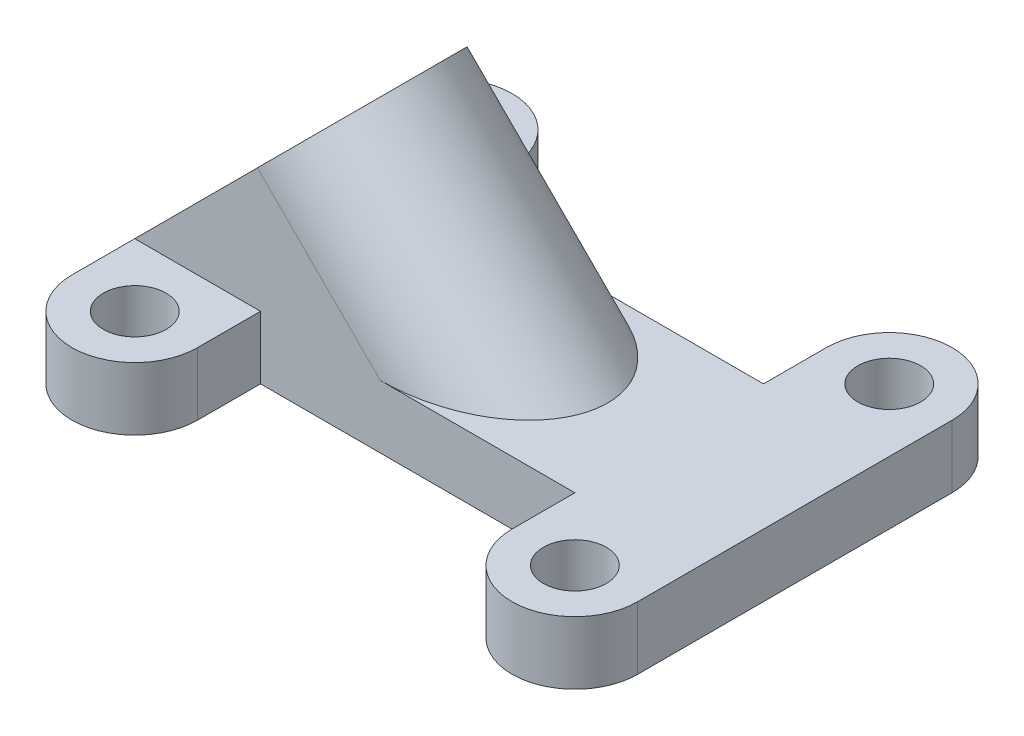
ISO-10303-21;
HEADER;
FILE_DESCRIPTION(('STEP AP214'),'2;1');
FILE_NAME('part.step','',(''),(''),'','','');
FILE_SCHEMA(('AUTOMOTIVE_DESIGN { 1 0 10303 214 1 1 1 1 }'));
ENDSEC;
DATA;
#1=APPLICATION_CONTEXT('core data for automotive mechanical design processes');
#2=APPLICATION_PROTOCOL_DEFINITION('international standard','automotive_design',2000,#1);
#3=PRODUCT_CONTEXT('',#1,'mechanical');
#4=PRODUCT('Part','Part','',(#3));
#5=PRODUCT_RELATED_PRODUCT_CATEGORY('part','',(#4));
#6=PRODUCT_DEFINITION_FORMATION('','',#4);
#7=PRODUCT_DEFINITION_CONTEXT('part definition',#1,'design');
#8=PRODUCT_DEFINITION('design','',#6,#7);
#9=PRODUCT_DEFINITION_SHAPE('','',#8);
#10=(LENGTH_UNIT() NAMED_UNIT(*) SI_UNIT(.MILLI.,.METRE.));
#11=(NAMED_UNIT(*) PLANE_ANGLE_UNIT() SI_UNIT($,.RADIAN.));
#12=(NAMED_UNIT(*) SI_UNIT($,.STERADIAN.) SOLID_ANGLE_UNIT());
#13=UNCERTAINTY_MEASURE_WITH_UNIT(LENGTH_MEASURE(1.E-05),#10,'distance_accuracy_value','');
#14=(GEOMETRIC_REPRESENTATION_CONTEXT(3) GLOBAL_UNCERTAINTY_ASSIGNED_CONTEXT((#13)) GLOBAL_UNIT_ASSIGNED_CONTEXT((#10,
#11,#12)) REPRESENTATION_CONTEXT('',''));
#15=CARTESIAN_POINT('',(0.,0.,0.));
#16=DIRECTION('',(0.,0.,1.));
#17=DIRECTION('',(1.,0.,0.));
#18=AXIS2_PLACEMENT_3D('',#15,#16,#17);
#19=CARTESIAN_POINT('',(-17.5,5.,-12.5));
#20=DIRECTION('',(0.,-1.,0.));
#21=DIRECTION('',(0.,0.,-1.));
#22=AXIS2_PLACEMENT_3D('',#19,#20,#21);
#23=PLANE('',#22);
#24=CARTESIAN_POINT('',(-17.5,5.,-12.5));
#25=DIRECTION('',(0.,1.,0.));
#26=DIRECTION('',(0.,0.,-1.));
#27=AXIS2_PLACEMENT_3D('',#24,#25,#26);
#28=CIRCLE('',#27,2.5);
#29=CARTESIAN_POINT('',(-17.5,5.,-15.));
#30=VERTEX_POINT('',#29);
#31=EDGE_CURVE('E191',#30,#30,#28,.T.);
#32=ORIENTED_EDGE('',*,*,#31,.F.);
#33=EDGE_LOOP('',(#32));
#34=FACE_BOUND('',#33,.T.);
#35=DIRECTION('',(0.,0.,1.));
#36=VECTOR('',#35,1.);
#37=CARTESIAN_POINT('',(-22.5,5.,-12.5));
#38=LINE('',#37,#36);
#39=CARTESIAN_POINT('',(-22.5,5.,-12.5));
#40=VERTEX_POINT('',#39);
#41=CARTESIAN_POINT('',(-22.5,5.,-7.5));
#42=VERTEX_POINT('',#41);
#43=EDGE_CURVE('E210',#40,#42,#38,.T.);
#44=ORIENTED_EDGE('',*,*,#43,.T.);
#45=DIRECTION('',(1.,0.,0.));
#46=VECTOR('',#45,1.);
#47=CARTESIAN_POINT('',(-17.5,5.,-7.5));
#48=LINE('',#47,#46);
#49=CARTESIAN_POINT('',(-12.5,5.,-7.49999999999999));
#50=VERTEX_POINT('',#49);
#51=EDGE_CURVE('E163',#42,#50,#48,.T.);
#52=ORIENTED_EDGE('',*,*,#51,.T.);
#53=DIRECTION('',(0.,0.,-1.));
#54=VECTOR('',#53,1.);
#55=CARTESIAN_POINT('',(-12.5,5.,-7.49999999999999));
#56=LINE('',#55,#54);
#57=CARTESIAN_POINT('',(-12.5,5.,-12.5));
#58=VERTEX_POINT('',#57);
#59=EDGE_CURVE('E203',#50,#58,#56,.T.);
#60=ORIENTED_EDGE('',*,*,#59,.T.);
#61=CARTESIAN_POINT('',(-17.5,5.,-12.5));
#62=DIRECTION('',(0.,1.,0.));
#63=DIRECTION('',(0.,0.,-1.));
#64=AXIS2_PLACEMENT_3D('',#61,#62,#63);
#65=CIRCLE('',#64,5.00000000000001);
#66=EDGE_CURVE('E206',#58,#40,#65,.T.);
#67=ORIENTED_EDGE('',*,*,#66,.T.);
#68=EDGE_LOOP('',(#44,#52,#60,#67));
#69=FACE_BOUND('',#68,.T.);
#70=ADVANCED_FACE('F33',(#34,#69),#23,.F.);
#71=CARTESIAN_POINT('',(17.5,5.,-12.5));
#72=DIRECTION('',(0.,1.,0.));
#73=DIRECTION('',(0.,0.,1.));
#74=AXIS2_PLACEMENT_3D('',#71,#72,#73);
#75=CIRCLE('',#74,2.5);
#76=CARTESIAN_POINT('',(17.5,5.,-10.));
#77=VERTEX_POINT('',#76);
#78=EDGE_CURVE('E179',#77,#77,#75,.T.);
#79=ORIENTED_EDGE('',*,*,#78,.F.);
#80=EDGE_LOOP('',(#79));
#81=FACE_BOUND('',#80,.T.);
#82=CARTESIAN_POINT('',(17.5,5.,12.5));
#83=DIRECTION('',(0.,1.,0.));
#84=DIRECTION('',(0.,0.,-1.));
#85=AXIS2_PLACEMENT_3D('',#82,#83,#84);
#86=CIRCLE('',#85,2.5);
#87=CARTESIAN_POINT('',(17.5,5.,10.));
#88=VERTEX_POINT('',#87);
#89=EDGE_CURVE('E185',#88,#88,#86,.T.);
#90=ORIENTED_EDGE('',*,*,#89,.F.);
#91=EDGE_LOOP('',(#90));
#92=FACE_BOUND('',#91,.T.);
#93=DIRECTION('',(-1.,0.,0.));
#94=VECTOR('',#93,1.);
#95=CARTESIAN_POINT('',(-12.5,5.,-7.49999999999999));
#96=LINE('',#95,#94);
#97=CARTESIAN_POINT('',(12.5,5.,-7.5));
#98=VERTEX_POINT('',#97);
#99=CARTESIAN_POINT('',(-2.98385283925117,5.,-7.5));
#100=VERTEX_POINT('',#99);
#101=EDGE_CURVE('E228',#98,#100,#96,.T.);
#102=ORIENTED_EDGE('',*,*,#101,.T.);
#103=CARTESIAN_POINT('',(-2.98385283925118,5.,0.));
#104=DIRECTION('',(0.,-1.,0.));
#105=DIRECTION('',(-1.,0.,0.));
#106=AXIS2_PLACEMENT_3D('',#103,#104,#105);
#107=ELLIPSE('',#106,10.6066017177983,7.5);
#108=CARTESIAN_POINT('',(-2.98385283925116,4.99999999999999,7.5));
#109=VERTEX_POINT('',#108);
#110=EDGE_CURVE('E56',#100,#109,#107,.T.);
#111=ORIENTED_EDGE('',*,*,#110,.T.);
#112=DIRECTION('',(1.,0.,0.));
#113=VECTOR('',#112,1.);
#114=CARTESIAN_POINT('',(-12.5,5.,7.5));
#115=LINE('',#114,#113);
#116=CARTESIAN_POINT('',(12.5,5.,7.5));
#117=VERTEX_POINT('',#116);
#118=EDGE_CURVE('E216',#109,#117,#115,.T.);
#119=ORIENTED_EDGE('',*,*,#118,.T.);
#120=DIRECTION('',(0.,0.,1.));
#121=VECTOR('',#120,1.);
#122=CARTESIAN_POINT('',(12.5,5.,7.5));
#123=LINE('',#122,#121);
#124=CARTESIAN_POINT('',(12.5,5.,12.5));
#125=VERTEX_POINT('',#124);
#126=EDGE_CURVE('E218',#117,#125,#123,.T.);
#127=ORIENTED_EDGE('',*,*,#126,.T.);
#128=CARTESIAN_POINT('',(17.5,5.,12.5));
#129=DIRECTION('',(0.,1.,0.));
#130=DIRECTION('',(0.,0.,-1.));
#131=AXIS2_PLACEMENT_3D('',#128,#129,#130);
#132=CIRCLE('',#131,5.00000000000001);
#133=CARTESIAN_POINT('',(22.5,5.,12.5));
#134=VERTEX_POINT('',#133);
#135=EDGE_CURVE('E220',#125,#134,#132,.T.);
#136=ORIENTED_EDGE('',*,*,#135,.T.);
#137=DIRECTION('',(0.,0.,-1.));
#138=VECTOR('',#137,1.);
#139=CARTESIAN_POINT('',(22.5,5.,-12.5));
#140=LINE('',#139,#138);
#141=CARTESIAN_POINT('',(22.5,5.,-12.5));
#142=VERTEX_POINT('',#141);
#143=EDGE_CURVE('E222',#134,#142,#140,.T.);
#144=ORIENTED_EDGE('',*,*,#143,.T.);
#145=CARTESIAN_POINT('',(17.5,5.,-12.5));
#146=DIRECTION('',(0.,1.,0.));
#147=DIRECTION('',(0.,0.,-1.));
#148=AXIS2_PLACEMENT_3D('',#145,#146,#147);
#149=CIRCLE('',#148,5.);
#150=CARTESIAN_POINT('',(12.5,5.,-12.5));
#151=VERTEX_POINT('',#150);
#152=EDGE_CURVE('E224',#142,#151,#149,.T.);
#153=ORIENTED_EDGE('',*,*,#152,.T.);
#154=DIRECTION('',(0.,0.,1.));
#155=VECTOR('',#154,1.);
#156=CARTESIAN_POINT('',(12.5,5.,-7.5));
#157=LINE('',#156,#155);
#158=EDGE_CURVE('E226',#151,#98,#157,.T.);
#159=ORIENTED_EDGE('',*,*,#158,.T.);
#160=EDGE_LOOP('',(#102,#111,#119,#127,#136,#144,#153,#159));
#161=FACE_BOUND('',#160,.T.);
#162=ADVANCED_FACE('F311',(#81,#92,#161),#23,.F.);
#163=DIRECTION('',(0.,0.,-1.));
#164=VECTOR('',#163,1.);
#165=CARTESIAN_POINT('',(-12.5,5.,7.5));
#166=LINE('',#165,#164);
#167=CARTESIAN_POINT('',(-12.5,5.,12.5));
#168=VERTEX_POINT('',#167);
#169=CARTESIAN_POINT('',(-12.5,5.,7.5));
#170=VERTEX_POINT('',#169);
#171=EDGE_CURVE('E214',#168,#170,#166,.T.);
#172=ORIENTED_EDGE('',*,*,#171,.T.);
#173=DIRECTION('',(-1.,0.,0.));
#174=VECTOR('',#173,1.);
#175=CARTESIAN_POINT('',(-17.5,5.,7.5));
#176=LINE('',#175,#174);
#177=CARTESIAN_POINT('',(-22.5,5.,7.5));
#178=VERTEX_POINT('',#177);
#179=EDGE_CURVE('E165',#170,#178,#176,.T.);
#180=ORIENTED_EDGE('',*,*,#179,.T.);
#181=CARTESIAN_POINT('',(-22.5,5.,12.5));
#182=VERTEX_POINT('',#181);
#183=EDGE_CURVE('E209',#178,#182,#38,.T.);
#184=ORIENTED_EDGE('',*,*,#183,.T.);
#185=CARTESIAN_POINT('',(-17.5,5.,12.5));
#186=DIRECTION('',(0.,1.,0.));
#187=DIRECTION('',(0.,0.,1.));
#188=AXIS2_PLACEMENT_3D('',#185,#186,#187);
#189=CIRCLE('',#188,5.00000000000001);
#190=EDGE_CURVE('E212',#182,#168,#189,.T.);
#191=ORIENTED_EDGE('',*,*,#190,.T.);
#192=EDGE_LOOP('',(#172,#180,#184,#191));
#193=FACE_BOUND('',#192,.T.);
#194=CARTESIAN_POINT('',(-17.5,5.,12.5));
#195=DIRECTION('',(0.,1.,0.));
#196=DIRECTION('',(0.,0.,1.));
#197=AXIS2_PLACEMENT_3D('',#194,#195,#196);
#198=CIRCLE('',#197,2.5);
#199=CARTESIAN_POINT('',(-17.5,5.,15.));
#200=VERTEX_POINT('',#199);
#201=EDGE_CURVE('E197',#200,#200,#198,.T.);
#202=ORIENTED_EDGE('',*,*,#201,.F.);
#203=EDGE_LOOP('',(#202));
#204=FACE_BOUND('',#203,.T.);
#205=ADVANCED_FACE('F305',(#193,#204),#23,.F.);
#206=CARTESIAN_POINT('',(-17.5,0.,-12.5));
#207=DIRECTION('',(0.,-1.,0.));
#208=DIRECTION('',(0.,0.,-1.));
#209=AXIS2_PLACEMENT_3D('',#206,#207,#208);
#210=PLANE('',#209);
#211=CARTESIAN_POINT('',(2.01614716074888,0.,0.));
#212=DIRECTION('',(0.,-1.,0.));
#213=DIRECTION('',(-1.,0.,0.));
#214=AXIS2_PLACEMENT_3D('',#211,#212,#213);
#215=ELLIPSE('',#214,4.24264068711931,3.);
#216=CARTESIAN_POINT('',(-2.22649352637043,0.,0.));
#217=VERTEX_POINT('',#216);
#218=EDGE_CURVE('E151',#217,#217,#215,.T.);
#219=ORIENTED_EDGE('',*,*,#218,.F.);
#220=EDGE_LOOP('',(#219));
#221=FACE_BOUND('',#220,.T.);
#222=DIRECTION('',(0.,0.,-1.));
#223=VECTOR('',#222,1.);
#224=CARTESIAN_POINT('',(-12.5,0.,-7.49999999999999));
#225=LINE('',#224,#223);
#226=CARTESIAN_POINT('',(-12.5,0.,-7.49999999999999));
#227=VERTEX_POINT('',#226);
#228=CARTESIAN_POINT('',(-12.5,0.,-12.5));
#229=VERTEX_POINT('',#228);
#230=EDGE_CURVE('E200',#227,#229,#225,.T.);
#231=ORIENTED_EDGE('',*,*,#230,.F.);
#232=DIRECTION('',(-1.,0.,0.));
#233=VECTOR('',#232,1.);
#234=CARTESIAN_POINT('',(-12.5,0.,-7.49999999999999));
#235=LINE('',#234,#233);
#236=CARTESIAN_POINT('',(12.5,0.,-7.5));
#237=VERTEX_POINT('',#236);
#238=EDGE_CURVE('E207',#237,#227,#235,.T.);
#239=ORIENTED_EDGE('',*,*,#238,.F.);
#240=DIRECTION('',(0.,0.,1.));
#241=VECTOR('',#240,1.);
#242=CARTESIAN_POINT('',(12.5,0.,-7.5));
#243=LINE('',#242,#241);
#244=CARTESIAN_POINT('',(12.5,0.,-12.5));
#245=VERTEX_POINT('',#244);
#246=EDGE_CURVE('E251',#245,#237,#243,.T.);
#247=ORIENTED_EDGE('',*,*,#246,.F.);
#248=CARTESIAN_POINT('',(17.5,0.,-12.5));
#249=DIRECTION('',(0.,1.,0.));
#250=DIRECTION('',(0.,0.,-1.));
#251=AXIS2_PLACEMENT_3D('',#248,#249,#250);
#252=CIRCLE('',#251,5.);
#253=CARTESIAN_POINT('',(22.5,0.,-12.5));
#254=VERTEX_POINT('',#253);
#255=EDGE_CURVE('E249',#254,#245,#252,.T.);
#256=ORIENTED_EDGE('',*,*,#255,.F.);
#257=DIRECTION('',(0.,0.,-1.));
#258=VECTOR('',#257,1.);
#259=CARTESIAN_POINT('',(22.5,0.,-12.5));
#260=LINE('',#259,#258);
#261=CARTESIAN_POINT('',(22.5,0.,12.5));
#262=VERTEX_POINT('',#261);
#263=EDGE_CURVE('E247',#262,#254,#260,.T.);
#264=ORIENTED_EDGE('',*,*,#263,.F.);
#265=CARTESIAN_POINT('',(17.5,0.,12.5));
#266=DIRECTION('',(0.,1.,0.));
#267=DIRECTION('',(0.,0.,-1.));
#268=AXIS2_PLACEMENT_3D('',#265,#266,#267);
#269=CIRCLE('',#268,5.00000000000001);
#270=CARTESIAN_POINT('',(12.5,0.,12.5));
#271=VERTEX_POINT('',#270);
#272=EDGE_CURVE('E245',#271,#262,#269,.T.);
#273=ORIENTED_EDGE('',*,*,#272,.F.);
#274=DIRECTION('',(0.,0.,1.));
#275=VECTOR('',#274,1.);
#276=CARTESIAN_POINT('',(12.5,0.,7.5));
#277=LINE('',#276,#275);
#278=CARTESIAN_POINT('',(12.5,0.,7.5));
#279=VERTEX_POINT('',#278);
#280=EDGE_CURVE('E243',#279,#271,#277,.T.);
#281=ORIENTED_EDGE('',*,*,#280,.F.);
#282=DIRECTION('',(1.,0.,0.));
#283=VECTOR('',#282,1.);
#284=CARTESIAN_POINT('',(-12.5,0.,7.5));
#285=LINE('',#284,#283);
#286=CARTESIAN_POINT('',(-12.5,0.,7.5));
#287=VERTEX_POINT('',#286);
#288=EDGE_CURVE('E241',#287,#279,#285,.T.);
#289=ORIENTED_EDGE('',*,*,#288,.F.);
#290=DIRECTION('',(0.,0.,-1.));
#291=VECTOR('',#290,1.);
#292=CARTESIAN_POINT('',(-12.5,0.,7.5));
#293=LINE('',#292,#291);
#294=CARTESIAN_POINT('',(-12.5,0.,12.5));
#295=VERTEX_POINT('',#294);
#296=EDGE_CURVE('E239',#295,#287,#293,.T.);
#297=ORIENTED_EDGE('',*,*,#296,.F.);
#298=CARTESIAN_POINT('',(-17.5,0.,12.5));
#299=DIRECTION('',(0.,1.,0.));
#300=DIRECTION('',(0.,0.,1.));
#301=AXIS2_PLACEMENT_3D('',#298,#299,#300);
#302=CIRCLE('',#301,5.00000000000001);
#303=CARTESIAN_POINT('',(-22.5,0.,12.5));
#304=VERTEX_POINT('',#303);
#305=EDGE_CURVE('E237',#304,#295,#302,.T.);
#306=ORIENTED_EDGE('',*,*,#305,.F.);
#307=DIRECTION('',(0.,0.,1.));
#308=VECTOR('',#307,1.);
#309=CARTESIAN_POINT('',(-22.5,0.,-12.5));
#310=LINE('',#309,#308);
#311=CARTESIAN_POINT('',(-22.5,0.,-12.5));
#312=VERTEX_POINT('',#311);
#313=EDGE_CURVE('E235',#312,#304,#310,.T.);
#314=ORIENTED_EDGE('',*,*,#313,.F.);
#315=CARTESIAN_POINT('',(-17.5,0.,-12.5));
#316=DIRECTION('',(0.,1.,0.));
#317=DIRECTION('',(0.,0.,-1.));
#318=AXIS2_PLACEMENT_3D('',#315,#316,#317);
#319=CIRCLE('',#318,5.00000000000001);
#320=EDGE_CURVE('E233',#229,#312,#319,.T.);
#321=ORIENTED_EDGE('',*,*,#320,.F.);
#322=EDGE_LOOP('',(#231,#239,#247,#256,#264,#273,#281,#289,#297,#306,#314,#321));
#323=FACE_BOUND('',#322,.T.);
#324=CARTESIAN_POINT('',(-17.5,0.,12.5));
#325=DIRECTION('',(0.,1.,0.));
#326=DIRECTION('',(0.,0.,1.));
#327=AXIS2_PLACEMENT_3D('',#324,#325,#326);
#328=CIRCLE('',#327,2.5);
#329=CARTESIAN_POINT('',(-17.5,0.,15.));
#330=VERTEX_POINT('',#329);
#331=EDGE_CURVE('E194',#330,#330,#328,.T.);
#332=ORIENTED_EDGE('',*,*,#331,.T.);
#333=EDGE_LOOP('',(#332));
#334=FACE_BOUND('',#333,.T.);
#335=CARTESIAN_POINT('',(-17.5,0.,-12.5));
#336=DIRECTION('',(0.,1.,0.));
#337=DIRECTION('',(0.,0.,-1.));
#338=AXIS2_PLACEMENT_3D('',#335,#336,#337);
#339=CIRCLE('',#338,2.5);
#340=CARTESIAN_POINT('',(-17.5,0.,-15.));
#341=VERTEX_POINT('',#340);
#342=EDGE_CURVE('E188',#341,#341,#339,.T.);
#343=ORIENTED_EDGE('',*,*,#342,.T.);
#344=EDGE_LOOP('',(#343));
#345=FACE_BOUND('',#344,.T.);
#346=CARTESIAN_POINT('',(17.5,0.,-12.5));
#347=DIRECTION('',(0.,1.,0.));
#348=DIRECTION('',(0.,0.,1.));
#349=AXIS2_PLACEMENT_3D('',#346,#347,#348);
#350=CIRCLE('',#349,2.5);
#351=CARTESIAN_POINT('',(17.5,0.,-10.));
#352=VERTEX_POINT('',#351);
#353=EDGE_CURVE('E178',#352,#352,#350,.T.);
#354=ORIENTED_EDGE('',*,*,#353,.T.);
#355=EDGE_LOOP('',(#354));
#356=FACE_BOUND('',#355,.T.);
#357=CARTESIAN_POINT('',(17.5,0.,12.5));
#358=DIRECTION('',(0.,1.,0.));
#359=DIRECTION('',(0.,0.,-1.));
#360=AXIS2_PLACEMENT_3D('',#357,#358,#359);
#361=CIRCLE('',#360,2.5);
#362=CARTESIAN_POINT('',(17.5,0.,10.));
#363=VERTEX_POINT('',#362);
#364=EDGE_CURVE('E182',#363,#363,#361,.T.);
#365=ORIENTED_EDGE('',*,*,#364,.T.);
#366=EDGE_LOOP('',(#365));
#367=FACE_BOUND('',#366,.T.);
#368=ADVANCED_FACE('F291',(#221,#323,#334,#345,#356,#367),#210,.T.);
#369=CARTESIAN_POINT('',(-12.5,5.,-7.49999999999999));
#370=DIRECTION('',(-1.,0.,0.));
#371=DIRECTION('',(0.,0.,1.));
#372=AXIS2_PLACEMENT_3D('',#369,#370,#371);
#373=PLANE('',#372);
#374=ORIENTED_EDGE('',*,*,#230,.T.);
#375=DIRECTION('',(0.,-1.,0.));
#376=VECTOR('',#375,1.);
#377=CARTESIAN_POINT('',(-12.5,5.,-12.5));
#378=LINE('',#377,#376);
#379=EDGE_CURVE('E11',#58,#229,#378,.T.);
#380=ORIENTED_EDGE('',*,*,#379,.F.);
#381=ORIENTED_EDGE('',*,*,#59,.F.);
#382=DIRECTION('',(0.,-1.,0.));
#383=VECTOR('',#382,1.);
#384=CARTESIAN_POINT('',(-12.5,5.,-7.49999999999999));
#385=LINE('',#384,#383);
#386=EDGE_CURVE('E230',#50,#227,#385,.T.);
#387=ORIENTED_EDGE('',*,*,#386,.T.);
#388=EDGE_LOOP('',(#374,#380,#381,#387));
#389=FACE_BOUND('',#388,.T.);
#390=ADVANCED_FACE('F35',(#389),#373,.F.);
#391=CARTESIAN_POINT('',(-17.5,5.,-12.5));
#392=DIRECTION('',(0.,-1.,0.));
#393=DIRECTION('',(0.,0.,-1.));
#394=AXIS2_PLACEMENT_3D('',#391,#392,#393);
#395=CYLINDRICAL_SURFACE('',#394,5.00000000000001);
#396=ORIENTED_EDGE('',*,*,#320,.T.);
#397=DIRECTION('',(0.,-1.,0.));
#398=VECTOR('',#397,1.);
#399=CARTESIAN_POINT('',(-22.5,5.,-12.5));
#400=LINE('',#399,#398);
#401=EDGE_CURVE('E41',#40,#312,#400,.T.);
#402=ORIENTED_EDGE('',*,*,#401,.F.);
#403=ORIENTED_EDGE('',*,*,#66,.F.);
#404=ORIENTED_EDGE('',*,*,#379,.T.);
#405=EDGE_LOOP('',(#396,#402,#403,#404));
#406=FACE_BOUND('',#405,.T.);
#407=ADVANCED_FACE('F341',(#406),#395,.T.);
#408=CARTESIAN_POINT('',(-22.5,5.,-12.5));
#409=DIRECTION('',(1.,0.,0.));
#410=DIRECTION('',(0.,0.,-1.));
#411=AXIS2_PLACEMENT_3D('',#408,#409,#410);
#412=PLANE('',#411);
#413=ORIENTED_EDGE('',*,*,#313,.T.);
#414=DIRECTION('',(0.,-1.,0.));
#415=VECTOR('',#414,1.);
#416=CARTESIAN_POINT('',(-22.5,5.,12.5));
#417=LINE('',#416,#415);
#418=EDGE_CURVE('E280',#182,#304,#417,.T.);
#419=ORIENTED_EDGE('',*,*,#418,.F.);
#420=ORIENTED_EDGE('',*,*,#183,.F.);
#421=DIRECTION('',(0.,0.,1.));
#422=VECTOR('',#421,1.);
#423=CARTESIAN_POINT('',(-22.5,5.,-7.5));
#424=LINE('',#423,#422);
#425=EDGE_CURVE('E48',#42,#178,#424,.T.);
#426=ORIENTED_EDGE('',*,*,#425,.F.);
#427=ORIENTED_EDGE('',*,*,#43,.F.);
#428=ORIENTED_EDGE('',*,*,#401,.T.);
#429=EDGE_LOOP('',(#413,#419,#420,#426,#427,#428));
#430=FACE_BOUND('',#429,.T.);
#431=ADVANCED_FACE('F285',(#430),#412,.F.);
#432=CARTESIAN_POINT('',(-17.5,5.,12.5));
#433=DIRECTION('',(0.,-1.,0.));
#434=DIRECTION('',(0.,0.,-1.));
#435=AXIS2_PLACEMENT_3D('',#432,#433,#434);
#436=CYLINDRICAL_SURFACE('',#435,5.00000000000001);
#437=ORIENTED_EDGE('',*,*,#305,.T.);
#438=DIRECTION('',(0.,-1.,0.));
#439=VECTOR('',#438,1.);
#440=CARTESIAN_POINT('',(-12.5,5.,12.5));
#441=LINE('',#440,#439);
#442=EDGE_CURVE('E277',#168,#295,#441,.T.);
#443=ORIENTED_EDGE('',*,*,#442,.F.);
#444=ORIENTED_EDGE('',*,*,#190,.F.);
#445=ORIENTED_EDGE('',*,*,#418,.T.);
#446=EDGE_LOOP('',(#437,#443,#444,#445));
#447=FACE_BOUND('',#446,.T.);
#448=ADVANCED_FACE('F297',(#447),#436,.T.);
#449=CARTESIAN_POINT('',(-12.5,5.,7.5));
#450=DIRECTION('',(-1.,0.,0.));
#451=DIRECTION('',(0.,0.,1.));
#452=AXIS2_PLACEMENT_3D('',#449,#450,#451);
#453=PLANE('',#452);
#454=ORIENTED_EDGE('',*,*,#296,.T.);
#455=DIRECTION('',(0.,-1.,0.));
#456=VECTOR('',#455,1.);
#457=CARTESIAN_POINT('',(-12.5,5.,7.5));
#458=LINE('',#457,#456);
#459=EDGE_CURVE('E274',#170,#287,#458,.T.);
#460=ORIENTED_EDGE('',*,*,#459,.F.);
#461=ORIENTED_EDGE('',*,*,#171,.F.);
#462=ORIENTED_EDGE('',*,*,#442,.T.);
#463=EDGE_LOOP('',(#454,#460,#461,#462));
#464=FACE_BOUND('',#463,.T.);
#465=ADVANCED_FACE('F301',(#464),#453,.F.);
#466=CARTESIAN_POINT('',(-12.5,5.,7.5));
#467=DIRECTION('',(0.,0.,-1.));
#468=DIRECTION('',(-1.,0.,0.));
#469=AXIS2_PLACEMENT_3D('',#466,#467,#468);
#470=PLANE('',#469);
#471=ORIENTED_EDGE('',*,*,#288,.T.);
#472=DIRECTION('',(0.,-1.,0.));
#473=VECTOR('',#472,1.);
#474=CARTESIAN_POINT('',(12.5,5.,7.5));
#475=LINE('',#474,#473);
#476=EDGE_CURVE('E271',#117,#279,#475,.T.);
#477=ORIENTED_EDGE('',*,*,#476,.F.);
#478=ORIENTED_EDGE('',*,*,#118,.F.);
#479=DIRECTION('',(-0.707106781186551,0.707106781186544,0.));
#480=VECTOR('',#479,1.);
#481=CARTESIAN_POINT('',(22.0252600897321,-20.009112928983,7.5));
#482=LINE('',#481,#480);
#483=CARTESIAN_POINT('',(-12.7419264196257,14.7580735803744,7.5));
#484=VERTEX_POINT('',#483);
#485=EDGE_CURVE('E150',#109,#484,#482,.T.);
#486=ORIENTED_EDGE('',*,*,#485,.T.);
#487=DIRECTION('',(0.707106781186544,0.707106781186551,0.));
#488=VECTOR('',#487,1.);
#489=CARTESIAN_POINT('',(-12.7419264196257,14.7580735803744,7.5));
#490=LINE('',#489,#488);
#491=EDGE_CURVE('E158',#178,#484,#490,.T.);
#492=ORIENTED_EDGE('',*,*,#491,.F.);
#493=ORIENTED_EDGE('',*,*,#179,.F.);
#494=ORIENTED_EDGE('',*,*,#459,.T.);
#495=EDGE_LOOP('',(#471,#477,#478,#486,#492,#493,#494));
#496=FACE_BOUND('',#495,.T.);
#497=ADVANCED_FACE('F308',(#496),#470,.F.);
#498=CARTESIAN_POINT('',(12.5,5.,7.5));
#499=DIRECTION('',(1.,0.,0.));
#500=DIRECTION('',(0.,0.,-1.));
#501=AXIS2_PLACEMENT_3D('',#498,#499,#500);
#502=PLANE('',#501);
#503=ORIENTED_EDGE('',*,*,#280,.T.);
#504=DIRECTION('',(0.,-1.,0.));
#505=VECTOR('',#504,1.);
#506=CARTESIAN_POINT('',(12.5,5.,12.5));
#507=LINE('',#506,#505);
#508=EDGE_CURVE('E268',#125,#271,#507,.T.);
#509=ORIENTED_EDGE('',*,*,#508,.F.);
#510=ORIENTED_EDGE('',*,*,#126,.F.);
#511=ORIENTED_EDGE('',*,*,#476,.T.);
#512=EDGE_LOOP('',(#503,#509,#510,#511));
#513=FACE_BOUND('',#512,.T.);
#514=ADVANCED_FACE('F316',(#513),#502,.F.);
#515=CARTESIAN_POINT('',(17.5,5.,12.5));
#516=DIRECTION('',(0.,-1.,0.));
#517=DIRECTION('',(0.,0.,-1.));
#518=AXIS2_PLACEMENT_3D('',#515,#516,#517);
#519=CYLINDRICAL_SURFACE('',#518,5.00000000000001);
#520=ORIENTED_EDGE('',*,*,#272,.T.);
#521=DIRECTION('',(0.,-1.,0.));
#522=VECTOR('',#521,1.);
#523=CARTESIAN_POINT('',(22.5,5.,12.5));
#524=LINE('',#523,#522);
#525=EDGE_CURVE('E265',#134,#262,#524,.T.);
#526=ORIENTED_EDGE('',*,*,#525,.F.);
#527=ORIENTED_EDGE('',*,*,#135,.F.);
#528=ORIENTED_EDGE('',*,*,#508,.T.);
#529=EDGE_LOOP('',(#520,#526,#527,#528));
#530=FACE_BOUND('',#529,.T.);
#531=ADVANCED_FACE('F320',(#530),#519,.T.);
#532=CARTESIAN_POINT('',(22.5,5.,-12.5));
#533=DIRECTION('',(-1.,0.,0.));
#534=DIRECTION('',(0.,0.,1.));
#535=AXIS2_PLACEMENT_3D('',#532,#533,#534);
#536=PLANE('',#535);
#537=ORIENTED_EDGE('',*,*,#263,.T.);
#538=DIRECTION('',(0.,-1.,0.));
#539=VECTOR('',#538,1.);
#540=CARTESIAN_POINT('',(22.5,5.,-12.5));
#541=LINE('',#540,#539);
#542=EDGE_CURVE('E262',#142,#254,#541,.T.);
#543=ORIENTED_EDGE('',*,*,#542,.F.);
#544=ORIENTED_EDGE('',*,*,#143,.F.);
#545=ORIENTED_EDGE('',*,*,#525,.T.);
#546=EDGE_LOOP('',(#537,#543,#544,#545));
#547=FACE_BOUND('',#546,.T.);
#548=ADVANCED_FACE('F325',(#547),#536,.F.);
#549=CARTESIAN_POINT('',(17.5,5.,-12.5));
#550=DIRECTION('',(0.,-1.,0.));
#551=DIRECTION('',(0.,0.,-1.));
#552=AXIS2_PLACEMENT_3D('',#549,#550,#551);
#553=CYLINDRICAL_SURFACE('',#552,5.);
#554=ORIENTED_EDGE('',*,*,#255,.T.);
#555=DIRECTION('',(0.,-1.,0.));
#556=VECTOR('',#555,1.);
#557=CARTESIAN_POINT('',(12.5,5.,-12.5));
#558=LINE('',#557,#556);
#559=EDGE_CURVE('E259',#151,#245,#558,.T.);
#560=ORIENTED_EDGE('',*,*,#559,.F.);
#561=ORIENTED_EDGE('',*,*,#152,.F.);
#562=ORIENTED_EDGE('',*,*,#542,.T.);
#563=EDGE_LOOP('',(#554,#560,#561,#562));
#564=FACE_BOUND('',#563,.T.);
#565=ADVANCED_FACE('F331',(#564),#553,.T.);
#566=CARTESIAN_POINT('',(12.5,5.,-7.5));
#567=DIRECTION('',(1.,0.,0.));
#568=DIRECTION('',(0.,0.,-1.));
#569=AXIS2_PLACEMENT_3D('',#566,#567,#568);
#570=PLANE('',#569);
#571=ORIENTED_EDGE('',*,*,#246,.T.);
#572=DIRECTION('',(0.,-1.,0.));
#573=VECTOR('',#572,1.);
#574=CARTESIAN_POINT('',(12.5,5.,-7.5));
#575=LINE('',#574,#573);
#576=EDGE_CURVE('E256',#98,#237,#575,.T.);
#577=ORIENTED_EDGE('',*,*,#576,.F.);
#578=ORIENTED_EDGE('',*,*,#158,.F.);
#579=ORIENTED_EDGE('',*,*,#559,.T.);
#580=EDGE_LOOP('',(#571,#577,#578,#579));
#581=FACE_BOUND('',#580,.T.);
#582=ADVANCED_FACE('F335',(#581),#570,.F.);
#583=CARTESIAN_POINT('',(-12.5,5.,-7.49999999999999));
#584=DIRECTION('',(0.,0.,1.));
#585=DIRECTION('',(1.,0.,0.));
#586=AXIS2_PLACEMENT_3D('',#583,#584,#585);
#587=PLANE('',#586);
#588=ORIENTED_EDGE('',*,*,#238,.T.);
#589=ORIENTED_EDGE('',*,*,#386,.F.);
#590=ORIENTED_EDGE('',*,*,#51,.F.);
#591=DIRECTION('',(-0.707106781186544,-0.707106781186551,0.));
#592=VECTOR('',#591,1.);
#593=CARTESIAN_POINT('',(-22.5,5.,-7.5));
#594=LINE('',#593,#592);
#595=CARTESIAN_POINT('',(-12.7419264196257,14.7580735803744,-7.5));
#596=VERTEX_POINT('',#595);
#597=EDGE_CURVE('E156',#596,#42,#594,.T.);
#598=ORIENTED_EDGE('',*,*,#597,.F.);
#599=DIRECTION('',(-0.707106781186551,0.707106781186544,0.));
#600=VECTOR('',#599,1.);
#601=CARTESIAN_POINT('',(22.0252600897321,-20.009112928983,-7.5));
#602=LINE('',#601,#600);
#603=EDGE_CURVE('E141',#100,#596,#602,.T.);
#604=ORIENTED_EDGE('',*,*,#603,.F.);
#605=ORIENTED_EDGE('',*,*,#101,.F.);
#606=ORIENTED_EDGE('',*,*,#576,.T.);
#607=EDGE_LOOP('',(#588,#589,#590,#598,#604,#605,#606));
#608=FACE_BOUND('',#607,.T.);
#609=ADVANCED_FACE('F161',(#608),#587,.F.);
#610=CARTESIAN_POINT('',(-17.5,5.,12.5));
#611=DIRECTION('',(0.,-1.,0.));
#612=DIRECTION('',(0.,0.,-1.));
#613=AXIS2_PLACEMENT_3D('',#610,#611,#612);
#614=CYLINDRICAL_SURFACE('',#613,2.5);
#615=ORIENTED_EDGE('',*,*,#201,.T.);
#616=EDGE_LOOP('',(#615));
#617=FACE_BOUND('',#616,.T.);
#618=ORIENTED_EDGE('',*,*,#331,.F.);
#619=EDGE_LOOP('',(#618));
#620=FACE_BOUND('',#619,.T.);
#621=ADVANCED_FACE('F369',(#617,#620),#614,.F.);
#622=CARTESIAN_POINT('',(-17.5,5.,-12.5));
#623=DIRECTION('',(0.,-1.,0.));
#624=DIRECTION('',(0.,0.,-1.));
#625=AXIS2_PLACEMENT_3D('',#622,#623,#624);
#626=CYLINDRICAL_SURFACE('',#625,2.5);
#627=ORIENTED_EDGE('',*,*,#31,.T.);
#628=EDGE_LOOP('',(#627));
#629=FACE_BOUND('',#628,.T.);
#630=ORIENTED_EDGE('',*,*,#342,.F.);
#631=EDGE_LOOP('',(#630));
#632=FACE_BOUND('',#631,.T.);
#633=ADVANCED_FACE('F428',(#629,#632),#626,.F.);
#634=CARTESIAN_POINT('',(17.5,5.,12.5));
#635=DIRECTION('',(0.,-1.,0.));
#636=DIRECTION('',(0.,0.,-1.));
#637=AXIS2_PLACEMENT_3D('',#634,#635,#636);
#638=CYLINDRICAL_SURFACE('',#637,2.5);
#639=ORIENTED_EDGE('',*,*,#89,.T.);
#640=EDGE_LOOP('',(#639));
#641=FACE_BOUND('',#640,.T.);
#642=ORIENTED_EDGE('',*,*,#364,.F.);
#643=EDGE_LOOP('',(#642));
#644=FACE_BOUND('',#643,.T.);
#645=ADVANCED_FACE('F435',(#641,#644),#638,.F.);
#646=CARTESIAN_POINT('',(17.5,5.,-12.5));
#647=DIRECTION('',(0.,-1.,0.));
#648=DIRECTION('',(0.,0.,-1.));
#649=AXIS2_PLACEMENT_3D('',#646,#647,#648);
#650=CYLINDRICAL_SURFACE('',#649,2.5);
#651=ORIENTED_EDGE('',*,*,#78,.T.);
#652=EDGE_LOOP('',(#651));
#653=FACE_BOUND('',#652,.T.);
#654=ORIENTED_EDGE('',*,*,#353,.F.);
#655=EDGE_LOOP('',(#654));
#656=FACE_BOUND('',#655,.T.);
#657=ADVANCED_FACE('F443',(#653,#656),#650,.F.);
#658=CARTESIAN_POINT('',(22.0252600897321,-20.009112928983,0.));
#659=DIRECTION('',(-0.707106781186551,0.707106781186544,0.));
#660=DIRECTION('',(-0.707106781186544,-0.707106781186551,0.));
#661=AXIS2_PLACEMENT_3D('',#658,#659,#660);
#662=CYLINDRICAL_SURFACE('',#661,3.);
#663=CARTESIAN_POINT('',(-12.7419264196257,14.7580735803744,0.));
#664=DIRECTION('',(-0.707106781186551,0.707106781186544,0.));
#665=DIRECTION('',(-0.707106781186544,-0.707106781186551,0.));
#666=AXIS2_PLACEMENT_3D('',#663,#664,#665);
#667=CIRCLE('',#666,3.);
#668=CARTESIAN_POINT('',(-14.8632467631853,12.6367532368148,0.));
#669=VERTEX_POINT('',#668);
#670=EDGE_CURVE('E171',#669,#669,#667,.T.);
#671=ORIENTED_EDGE('',*,*,#670,.T.);
#672=EDGE_LOOP('',(#671));
#673=FACE_BOUND('',#672,.T.);
#674=ORIENTED_EDGE('',*,*,#218,.T.);
#675=EDGE_LOOP('',(#674));
#676=FACE_BOUND('',#675,.T.);
#677=ADVANCED_FACE('F451',(#673,#676),#662,.F.);
#678=CARTESIAN_POINT('',(22.0252600897321,-20.009112928983,0.));
#679=DIRECTION('',(-0.707106781186551,0.707106781186544,0.));
#680=DIRECTION('',(-0.707106781186544,-0.707106781186551,0.));
#681=AXIS2_PLACEMENT_3D('',#678,#679,#680);
#682=CYLINDRICAL_SURFACE('',#681,7.5);
#683=ORIENTED_EDGE('',*,*,#110,.F.);
#684=ORIENTED_EDGE('',*,*,#603,.T.);
#685=CARTESIAN_POINT('',(-12.7419264196257,14.7580735803744,0.));
#686=DIRECTION('',(-0.707106781186551,0.707106781186544,0.));
#687=DIRECTION('',(0.707106781186544,0.707106781186551,0.));
#688=AXIS2_PLACEMENT_3D('',#685,#686,#687);
#689=CIRCLE('',#688,7.5);
#690=EDGE_CURVE('E145',#484,#596,#689,.T.);
#691=ORIENTED_EDGE('',*,*,#690,.F.);
#692=ORIENTED_EDGE('',*,*,#485,.F.);
#693=EDGE_LOOP('',(#683,#684,#691,#692));
#694=FACE_BOUND('',#693,.T.);
#695=ADVANCED_FACE('F143',(#694),#682,.T.);
#696=CARTESIAN_POINT('',(-12.7419264196257,14.7580735803744,0.));
#697=DIRECTION('',(0.707106781186551,-0.707106781186544,0.));
#698=DIRECTION('',(0.707106781186544,0.707106781186551,0.));
#699=AXIS2_PLACEMENT_3D('',#696,#697,#698);
#700=PLANE('',#699);
#701=ORIENTED_EDGE('',*,*,#670,.F.);
#702=EDGE_LOOP('',(#701));
#703=FACE_BOUND('',#702,.T.);
#704=ORIENTED_EDGE('',*,*,#425,.T.);
#705=ORIENTED_EDGE('',*,*,#491,.T.);
#706=ORIENTED_EDGE('',*,*,#690,.T.);
#707=ORIENTED_EDGE('',*,*,#597,.T.);
#708=EDGE_LOOP('',(#704,#705,#706,#707));
#709=FACE_BOUND('',#708,.T.);
#710=ADVANCED_FACE('F155',(#703,#709),#700,.F.);
#711=CLOSED_SHELL('',(#70,#162,#205,#368,#390,#407,#431,#448,#465,#497,#514,#531,#548,#565,#582,
#609,#621,#633,#645,#657,#677,#695,#710));
#712=MANIFOLD_SOLID_BREP('B2',#711);
#713=ADVANCED_BREP_SHAPE_REPRESENTATION('',(#18,#712),#14);
#714=SHAPE_DEFINITION_REPRESENTATION(#9,#713);
ENDSEC;
END-ISO-10303-21;
